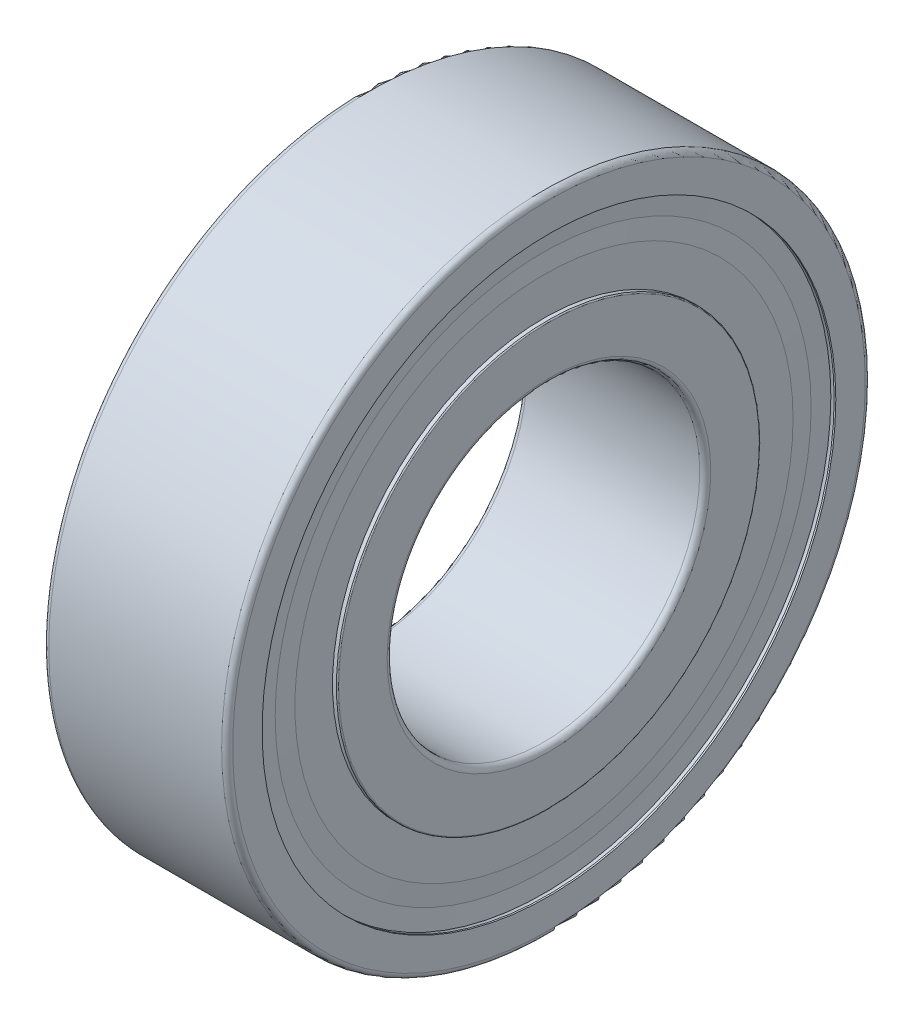
ISO-10303-21;
HEADER;
FILE_DESCRIPTION(('STEP AP214'),'2;1');
FILE_NAME('part.step','',(''),(''),'','','');
FILE_SCHEMA(('AUTOMOTIVE_DESIGN { 1 0 10303 214 1 1 1 1 }'));
ENDSEC;
DATA;
#1=APPLICATION_CONTEXT('core data for automotive mechanical design processes');
#2=APPLICATION_PROTOCOL_DEFINITION('international standard','automotive_design',2000,#1);
#3=PRODUCT_CONTEXT('',#1,'mechanical');
#4=PRODUCT('Part','Part','',(#3));
#5=PRODUCT_RELATED_PRODUCT_CATEGORY('part','',(#4));
#6=PRODUCT_DEFINITION_FORMATION('','',#4);
#7=PRODUCT_DEFINITION_CONTEXT('part definition',#1,'design');
#8=PRODUCT_DEFINITION('design','',#6,#7);
#9=PRODUCT_DEFINITION_SHAPE('','',#8);
#10=(LENGTH_UNIT() NAMED_UNIT(*) SI_UNIT(.MILLI.,.METRE.));
#11=(NAMED_UNIT(*) PLANE_ANGLE_UNIT() SI_UNIT($,.RADIAN.));
#12=(NAMED_UNIT(*) SI_UNIT($,.STERADIAN.) SOLID_ANGLE_UNIT());
#13=UNCERTAINTY_MEASURE_WITH_UNIT(LENGTH_MEASURE(1.E-05),#10,'distance_accuracy_value','');
#14=(GEOMETRIC_REPRESENTATION_CONTEXT(3) GLOBAL_UNCERTAINTY_ASSIGNED_CONTEXT((#13)) GLOBAL_UNIT_ASSIGNED_CONTEXT((#10,
#11,#12)) REPRESENTATION_CONTEXT('',''));
#15=CARTESIAN_POINT('',(0.,0.,0.));
#16=DIRECTION('',(0.,0.,1.));
#17=DIRECTION('',(1.,0.,0.));
#18=AXIS2_PLACEMENT_3D('',#15,#16,#17);
#19=CARTESIAN_POINT('',(50.,0.,0.));
#20=DIRECTION('',(1.,0.,0.));
#21=DIRECTION('',(0.,0.,-1.));
#22=AXIS2_PLACEMENT_3D('',#19,#20,#21);
#23=CYLINDRICAL_SURFACE('',#22,15.6);
#24=CARTESIAN_POINT('',(9.73,0.,0.));
#25=DIRECTION('',(1.,0.,0.));
#26=DIRECTION('',(0.,0.,-1.));
#27=AXIS2_PLACEMENT_3D('',#24,#25,#26);
#28=CIRCLE('',#27,15.6);
#29=CARTESIAN_POINT('',(9.73,0.,-15.6));
#30=VERTEX_POINT('',#29);
#31=EDGE_CURVE('P0_E11',#30,#30,#28,.T.);
#32=ORIENTED_EDGE('',*,*,#31,.F.);
#33=EDGE_LOOP('',(#32));
#34=FACE_BOUND('',#33,.T.);
#35=CARTESIAN_POINT('',(9.64,0.,0.));
#36=DIRECTION('',(1.,0.,0.));
#37=DIRECTION('',(0.,0.,-1.));
#38=AXIS2_PLACEMENT_3D('',#35,#36,#37);
#39=CIRCLE('',#38,15.6);
#40=CARTESIAN_POINT('',(9.64,0.,-15.6));
#41=VERTEX_POINT('',#40);
#42=EDGE_CURVE('P0_E166',#41,#41,#39,.T.);
#43=ORIENTED_EDGE('',*,*,#42,.T.);
#44=EDGE_LOOP('',(#43));
#45=FACE_BOUND('',#44,.T.);
#46=ADVANCED_FACE('P0_F16',(#34,#45),#23,.T.);
#47=CARTESIAN_POINT('',(9.685,0.,0.));
#48=DIRECTION('',(1.,0.,0.));
#49=DIRECTION('',(0.,0.,-1.));
#50=AXIS2_PLACEMENT_3D('',#47,#48,#49);
#51=CONICAL_SURFACE('',#50,14.5725,1.52702867499964);
#52=CARTESIAN_POINT('',(9.685,0.,0.));
#53=DIRECTION('',(1.,0.,0.));
#54=DIRECTION('',(0.,0.,-1.));
#55=AXIS2_PLACEMENT_3D('',#52,#53,#54);
#56=CIRCLE('',#55,14.5725);
#57=CARTESIAN_POINT('',(9.685,0.,-14.5725));
#58=VERTEX_POINT('',#57);
#59=EDGE_CURVE('P0_E26',#58,#58,#56,.T.);
#60=ORIENTED_EDGE('',*,*,#59,.F.);
#61=EDGE_LOOP('',(#60));
#62=FACE_BOUND('',#61,.T.);
#63=ORIENTED_EDGE('',*,*,#31,.T.);
#64=EDGE_LOOP('',(#63));
#65=FACE_BOUND('',#64,.T.);
#66=ADVANCED_FACE('P0_F202',(#62,#65),#51,.F.);
#67=CARTESIAN_POINT('',(9.73,0.,0.));
#68=DIRECTION('',(-1.,0.,0.));
#69=DIRECTION('',(0.,0.,1.));
#70=AXIS2_PLACEMENT_3D('',#67,#68,#69);
#71=CONICAL_SURFACE('',#70,13.545,1.52702867499964);
#72=CARTESIAN_POINT('',(9.73,0.,0.));
#73=DIRECTION('',(1.,0.,0.));
#74=DIRECTION('',(0.,0.,-1.));
#75=AXIS2_PLACEMENT_3D('',#72,#73,#74);
#76=CIRCLE('',#75,13.545);
#77=CARTESIAN_POINT('',(9.73,0.,-13.545));
#78=VERTEX_POINT('',#77);
#79=EDGE_CURVE('P0_E142',#78,#78,#76,.T.);
#80=ORIENTED_EDGE('',*,*,#79,.F.);
#81=EDGE_LOOP('',(#80));
#82=FACE_BOUND('',#81,.T.);
#83=ORIENTED_EDGE('',*,*,#59,.T.);
#84=EDGE_LOOP('',(#83));
#85=FACE_BOUND('',#84,.T.);
#86=ADVANCED_FACE('P0_F199',(#82,#85),#71,.T.);
#87=CARTESIAN_POINT('',(9.73,11.49,0.));
#88=DIRECTION('',(1.,0.,0.));
#89=DIRECTION('',(0.,1.,0.));
#90=AXIS2_PLACEMENT_3D('',#87,#88,#89);
#91=PLANE('',#90);
#92=CARTESIAN_POINT('',(9.73,0.,0.));
#93=DIRECTION('',(-1.,0.,0.));
#94=DIRECTION('',(0.,0.,-1.));
#95=AXIS2_PLACEMENT_3D('',#92,#93,#94);
#96=CIRCLE('',#95,11.5);
#97=CARTESIAN_POINT('',(9.73,0.,-11.5));
#98=VERTEX_POINT('',#97);
#99=EDGE_CURVE('P0_E147',#98,#98,#96,.T.);
#100=ORIENTED_EDGE('',*,*,#99,.T.);
#101=EDGE_LOOP('',(#100));
#102=FACE_BOUND('',#101,.T.);
#103=ORIENTED_EDGE('',*,*,#79,.T.);
#104=EDGE_LOOP('',(#103));
#105=FACE_BOUND('',#104,.T.);
#106=ADVANCED_FACE('P0_F197',(#102,#105),#91,.T.);
#107=CARTESIAN_POINT('',(9.55,0.,0.));
#108=DIRECTION('',(-1.,0.,0.));
#109=DIRECTION('',(0.,0.,1.));
#110=AXIS2_PLACEMENT_3D('',#107,#108,#109);
#111=CONICAL_SURFACE('',#110,13.545,1.52702867499964);
#112=CARTESIAN_POINT('',(9.55,0.,0.));
#113=DIRECTION('',(1.,0.,0.));
#114=DIRECTION('',(0.,0.,-1.));
#115=AXIS2_PLACEMENT_3D('',#112,#113,#114);
#116=CIRCLE('',#115,13.545);
#117=CARTESIAN_POINT('',(9.55,0.,-13.545));
#118=VERTEX_POINT('',#117);
#119=EDGE_CURVE('P0_E169',#118,#118,#116,.T.);
#120=ORIENTED_EDGE('',*,*,#119,.F.);
#121=EDGE_LOOP('',(#120));
#122=FACE_BOUND('',#121,.T.);
#123=CARTESIAN_POINT('',(9.63956204379562,0.,0.));
#124=DIRECTION('',(1.,0.,0.));
#125=DIRECTION('',(0.,0.,1.));
#126=AXIS2_PLACEMENT_3D('',#123,#124,#125);
#127=CIRCLE('',#126,11.5);
#128=CARTESIAN_POINT('',(9.63956204379562,0.,11.5));
#129=VERTEX_POINT('',#128);
#130=EDGE_CURVE('P0_E124',#129,#129,#127,.T.);
#131=ORIENTED_EDGE('',*,*,#130,.T.);
#132=EDGE_LOOP('',(#131));
#133=FACE_BOUND('',#132,.T.);
#134=ADVANCED_FACE('P0_F18',(#122,#133),#111,.F.);
#135=CARTESIAN_POINT('',(9.55,14.5725,0.));
#136=DIRECTION('',(-1.,0.,0.));
#137=DIRECTION('',(0.,0.,1.));
#138=AXIS2_PLACEMENT_3D('',#135,#136,#137);
#139=PLANE('',#138);
#140=CARTESIAN_POINT('',(9.55,0.,0.));
#141=DIRECTION('',(1.,0.,0.));
#142=DIRECTION('',(0.,0.,-1.));
#143=AXIS2_PLACEMENT_3D('',#140,#141,#142);
#144=CIRCLE('',#143,14.5725);
#145=CARTESIAN_POINT('',(9.55,0.,-14.5725));
#146=VERTEX_POINT('',#145);
#147=EDGE_CURVE('P0_E165',#146,#146,#144,.T.);
#148=ORIENTED_EDGE('',*,*,#147,.F.);
#149=EDGE_LOOP('',(#148));
#150=FACE_BOUND('',#149,.T.);
#151=ORIENTED_EDGE('',*,*,#119,.T.);
#152=EDGE_LOOP('',(#151));
#153=FACE_BOUND('',#152,.T.);
#154=ADVANCED_FACE('P0_F243',(#150,#153),#139,.T.);
#155=CARTESIAN_POINT('',(9.64,0.,0.));
#156=DIRECTION('',(1.,0.,0.));
#157=DIRECTION('',(0.,0.,-1.));
#158=AXIS2_PLACEMENT_3D('',#155,#156,#157);
#159=CONICAL_SURFACE('',#158,15.6,1.48342806694239);
#160=ORIENTED_EDGE('',*,*,#42,.F.);
#161=EDGE_LOOP('',(#160));
#162=FACE_BOUND('',#161,.T.);
#163=ORIENTED_EDGE('',*,*,#147,.T.);
#164=EDGE_LOOP('',(#163));
#165=FACE_BOUND('',#164,.T.);
#166=ADVANCED_FACE('P0_F245',(#162,#165),#159,.T.);
#167=CARTESIAN_POINT('',(0.45,0.,0.));
#168=DIRECTION('',(-1.,0.,0.));
#169=DIRECTION('',(0.,0.,1.));
#170=AXIS2_PLACEMENT_3D('',#167,#168,#169);
#171=CONICAL_SURFACE('',#170,14.5725,1.48342806694239);
#172=CARTESIAN_POINT('',(0.45,0.,0.));
#173=DIRECTION('',(1.,0.,0.));
#174=DIRECTION('',(0.,0.,-1.));
#175=AXIS2_PLACEMENT_3D('',#172,#173,#174);
#176=CIRCLE('',#175,14.5725);
#177=CARTESIAN_POINT('',(0.45,0.,-14.5725));
#178=VERTEX_POINT('',#177);
#179=EDGE_CURVE('P0_E162',#178,#178,#176,.T.);
#180=ORIENTED_EDGE('',*,*,#179,.F.);
#181=EDGE_LOOP('',(#180));
#182=FACE_BOUND('',#181,.T.);
#183=CARTESIAN_POINT('',(0.36,0.,0.));
#184=DIRECTION('',(1.,0.,0.));
#185=DIRECTION('',(0.,0.,-1.));
#186=AXIS2_PLACEMENT_3D('',#183,#184,#185);
#187=CIRCLE('',#186,15.6);
#188=CARTESIAN_POINT('',(0.36,0.,-15.6));
#189=VERTEX_POINT('',#188);
#190=EDGE_CURVE('P0_E139',#189,#189,#187,.T.);
#191=ORIENTED_EDGE('',*,*,#190,.T.);
#192=EDGE_LOOP('',(#191));
#193=FACE_BOUND('',#192,.T.);
#194=ADVANCED_FACE('P0_F251',(#182,#193),#171,.T.);
#195=CARTESIAN_POINT('',(0.45,13.545,0.));
#196=DIRECTION('',(1.,0.,0.));
#197=DIRECTION('',(0.,1.,0.));
#198=AXIS2_PLACEMENT_3D('',#195,#196,#197);
#199=PLANE('',#198);
#200=CARTESIAN_POINT('',(0.45,0.,0.));
#201=DIRECTION('',(1.,0.,0.));
#202=DIRECTION('',(0.,0.,-1.));
#203=AXIS2_PLACEMENT_3D('',#200,#201,#202);
#204=CIRCLE('',#203,13.545);
#205=CARTESIAN_POINT('',(0.45,0.,-13.545));
#206=VERTEX_POINT('',#205);
#207=EDGE_CURVE('P0_E155',#206,#206,#204,.T.);
#208=ORIENTED_EDGE('',*,*,#207,.F.);
#209=EDGE_LOOP('',(#208));
#210=FACE_BOUND('',#209,.T.);
#211=ORIENTED_EDGE('',*,*,#179,.T.);
#212=EDGE_LOOP('',(#211));
#213=FACE_BOUND('',#212,.T.);
#214=ADVANCED_FACE('P0_F248',(#210,#213),#199,.T.);
#215=CARTESIAN_POINT('',(0.36,0.,0.));
#216=DIRECTION('',(1.,0.,0.));
#217=DIRECTION('',(0.,0.,-1.));
#218=AXIS2_PLACEMENT_3D('',#215,#216,#217);
#219=CONICAL_SURFACE('',#218,11.49,1.52702867499964);
#220=CARTESIAN_POINT('',(0.360437956204379,0.,0.));
#221=DIRECTION('',(-1.,0.,0.));
#222=DIRECTION('',(0.,0.,-1.));
#223=AXIS2_PLACEMENT_3D('',#220,#221,#222);
#224=CIRCLE('',#223,11.5);
#225=CARTESIAN_POINT('',(0.360437956204379,0.,-11.5));
#226=VERTEX_POINT('',#225);
#227=EDGE_CURVE('P0_E146',#226,#226,#224,.T.);
#228=ORIENTED_EDGE('',*,*,#227,.T.);
#229=EDGE_LOOP('',(#228));
#230=FACE_BOUND('',#229,.T.);
#231=ORIENTED_EDGE('',*,*,#207,.T.);
#232=EDGE_LOOP('',(#231));
#233=FACE_BOUND('',#232,.T.);
#234=ADVANCED_FACE('P0_F230',(#230,#233),#219,.F.);
#235=CARTESIAN_POINT('',(0.27,13.545,0.));
#236=DIRECTION('',(-1.,0.,0.));
#237=DIRECTION('',(0.,0.,1.));
#238=AXIS2_PLACEMENT_3D('',#235,#236,#237);
#239=PLANE('',#238);
#240=CARTESIAN_POINT('',(0.27,0.,0.));
#241=DIRECTION('',(1.,0.,0.));
#242=DIRECTION('',(0.,0.,-1.));
#243=AXIS2_PLACEMENT_3D('',#240,#241,#242);
#244=CIRCLE('',#243,13.545);
#245=CARTESIAN_POINT('',(0.27,0.,-13.545));
#246=VERTEX_POINT('',#245);
#247=EDGE_CURVE('P0_E138',#246,#246,#244,.T.);
#248=ORIENTED_EDGE('',*,*,#247,.F.);
#249=EDGE_LOOP('',(#248));
#250=FACE_BOUND('',#249,.T.);
#251=CARTESIAN_POINT('',(0.27,0.,0.));
#252=DIRECTION('',(1.,0.,0.));
#253=DIRECTION('',(0.,0.,1.));
#254=AXIS2_PLACEMENT_3D('',#251,#252,#253);
#255=CIRCLE('',#254,11.5);
#256=CARTESIAN_POINT('',(0.27,0.,11.5));
#257=VERTEX_POINT('',#256);
#258=EDGE_CURVE('P0_E148',#257,#257,#255,.T.);
#259=ORIENTED_EDGE('',*,*,#258,.T.);
#260=EDGE_LOOP('',(#259));
#261=FACE_BOUND('',#260,.T.);
#262=ADVANCED_FACE('P0_F226',(#250,#261),#239,.T.);
#263=CARTESIAN_POINT('',(0.315,0.,0.));
#264=DIRECTION('',(1.,0.,0.));
#265=DIRECTION('',(0.,0.,-1.));
#266=AXIS2_PLACEMENT_3D('',#263,#264,#265);
#267=CONICAL_SURFACE('',#266,14.5725,1.52702867499964);
#268=CARTESIAN_POINT('',(0.315,0.,0.));
#269=DIRECTION('',(1.,0.,0.));
#270=DIRECTION('',(0.,0.,-1.));
#271=AXIS2_PLACEMENT_3D('',#268,#269,#270);
#272=CIRCLE('',#271,14.5725);
#273=CARTESIAN_POINT('',(0.315,0.,-14.5725));
#274=VERTEX_POINT('',#273);
#275=EDGE_CURVE('P0_E136',#274,#274,#272,.T.);
#276=ORIENTED_EDGE('',*,*,#275,.F.);
#277=EDGE_LOOP('',(#276));
#278=FACE_BOUND('',#277,.T.);
#279=ORIENTED_EDGE('',*,*,#247,.T.);
#280=EDGE_LOOP('',(#279));
#281=FACE_BOUND('',#280,.T.);
#282=ADVANCED_FACE('P0_F229',(#278,#281),#267,.T.);
#283=CARTESIAN_POINT('',(0.27,0.,0.));
#284=DIRECTION('',(-1.,0.,0.));
#285=DIRECTION('',(0.,0.,1.));
#286=AXIS2_PLACEMENT_3D('',#283,#284,#285);
#287=CONICAL_SURFACE('',#286,15.6,1.52702867499964);
#288=CARTESIAN_POINT('',(0.27,0.,0.));
#289=DIRECTION('',(1.,0.,0.));
#290=DIRECTION('',(0.,0.,-1.));
#291=AXIS2_PLACEMENT_3D('',#288,#289,#290);
#292=CIRCLE('',#291,15.6);
#293=CARTESIAN_POINT('',(0.27,0.,-15.6));
#294=VERTEX_POINT('',#293);
#295=EDGE_CURVE('P0_E183',#294,#294,#292,.T.);
#296=ORIENTED_EDGE('',*,*,#295,.F.);
#297=EDGE_LOOP('',(#296));
#298=FACE_BOUND('',#297,.T.);
#299=ORIENTED_EDGE('',*,*,#275,.T.);
#300=EDGE_LOOP('',(#299));
#301=FACE_BOUND('',#300,.T.);
#302=ADVANCED_FACE('P0_F241',(#298,#301),#287,.F.);
#303=CARTESIAN_POINT('',(50.,0.,0.));
#304=DIRECTION('',(1.,0.,0.));
#305=DIRECTION('',(0.,0.,-1.));
#306=AXIS2_PLACEMENT_3D('',#303,#304,#305);
#307=CYLINDRICAL_SURFACE('',#306,15.6);
#308=ORIENTED_EDGE('',*,*,#190,.F.);
#309=EDGE_LOOP('',(#308));
#310=FACE_BOUND('',#309,.T.);
#311=ORIENTED_EDGE('',*,*,#295,.T.);
#312=EDGE_LOOP('',(#311));
#313=FACE_BOUND('',#312,.T.);
#314=ADVANCED_FACE('P0_F270',(#310,#313),#307,.T.);
#315=CARTESIAN_POINT('',(50.,0.,0.));
#316=DIRECTION('',(1.,0.,0.));
#317=DIRECTION('',(0.,0.,-1.));
#318=AXIS2_PLACEMENT_3D('',#315,#316,#317);
#319=CYLINDRICAL_SURFACE('',#318,11.5);
#320=CARTESIAN_POINT('',(3.15090265264373,0.,0.));
#321=DIRECTION('',(1.,0.,0.));
#322=DIRECTION('',(0.,0.,-1.));
#323=AXIS2_PLACEMENT_3D('',#320,#321,#322);
#324=CIRCLE('',#323,11.5);
#325=CARTESIAN_POINT('',(3.15090265264373,0.,-11.5));
#326=VERTEX_POINT('',#325);
#327=EDGE_CURVE('P0_E143',#326,#326,#324,.T.);
#328=ORIENTED_EDGE('',*,*,#327,.F.);
#329=EDGE_LOOP('',(#328));
#330=FACE_BOUND('',#329,.T.);
#331=ORIENTED_EDGE('',*,*,#227,.F.);
#332=EDGE_LOOP('',(#331));
#333=FACE_BOUND('',#332,.T.);
#334=ADVANCED_FACE('P0_F272',(#330,#333),#319,.T.);
#335=CARTESIAN_POINT('',(5.,0.,0.));
#336=DIRECTION('',(1.,0.,0.));
#337=DIRECTION('',(0.,0.,-1.));
#338=AXIS2_PLACEMENT_3D('',#335,#336,#337);
#339=TOROIDAL_SURFACE('',#338,13.,2.381);
#340=ORIENTED_EDGE('',*,*,#327,.T.);
#341=EDGE_LOOP('',(#340));
#342=FACE_BOUND('',#341,.T.);
#343=CARTESIAN_POINT('',(6.84909734735627,0.,0.));
#344=DIRECTION('',(1.,0.,0.));
#345=DIRECTION('',(0.,0.,-1.));
#346=AXIS2_PLACEMENT_3D('',#343,#344,#345);
#347=CIRCLE('',#346,11.5);
#348=CARTESIAN_POINT('',(6.84909734735627,0.,-11.5));
#349=VERTEX_POINT('',#348);
#350=EDGE_CURVE('P0_E120',#349,#349,#347,.T.);
#351=ORIENTED_EDGE('',*,*,#350,.F.);
#352=EDGE_LOOP('',(#351));
#353=FACE_BOUND('',#352,.T.);
#354=ADVANCED_FACE('P0_F268',(#342,#353),#339,.F.);
#355=CARTESIAN_POINT('',(50.,0.,0.));
#356=DIRECTION('',(1.,0.,0.));
#357=DIRECTION('',(0.,0.,-1.));
#358=AXIS2_PLACEMENT_3D('',#355,#356,#357);
#359=CYLINDRICAL_SURFACE('',#358,11.5);
#360=CARTESIAN_POINT('',(9.94,0.,0.));
#361=DIRECTION('',(1.,0.,0.));
#362=DIRECTION('',(0.,0.,-1.));
#363=AXIS2_PLACEMENT_3D('',#360,#361,#362);
#364=CIRCLE('',#363,11.5);
#365=CARTESIAN_POINT('',(9.94,0.,-11.5));
#366=VERTEX_POINT('',#365);
#367=EDGE_CURVE('P0_E173',#366,#366,#364,.T.);
#368=ORIENTED_EDGE('',*,*,#367,.F.);
#369=EDGE_LOOP('',(#368));
#370=FACE_BOUND('',#369,.T.);
#371=ORIENTED_EDGE('',*,*,#99,.F.);
#372=EDGE_LOOP('',(#371));
#373=FACE_BOUND('',#372,.T.);
#374=ADVANCED_FACE('P0_F234',(#370,#373),#359,.T.);
#375=CARTESIAN_POINT('',(9.94,0.,0.));
#376=DIRECTION('',(1.,0.,0.));
#377=DIRECTION('',(0.,0.,-1.));
#378=AXIS2_PLACEMENT_3D('',#375,#376,#377);
#379=TOROIDAL_SURFACE('',#378,11.44,0.0599999999999976);
#380=CARTESIAN_POINT('',(10.,0.,0.));
#381=DIRECTION('',(1.,0.,0.));
#382=DIRECTION('',(0.,0.,-1.));
#383=AXIS2_PLACEMENT_3D('',#380,#381,#382);
#384=CIRCLE('',#383,11.44);
#385=CARTESIAN_POINT('',(10.,0.,-11.44));
#386=VERTEX_POINT('',#385);
#387=EDGE_CURVE('P0_E160',#386,#386,#384,.T.);
#388=ORIENTED_EDGE('',*,*,#387,.F.);
#389=EDGE_LOOP('',(#388));
#390=FACE_BOUND('',#389,.T.);
#391=ORIENTED_EDGE('',*,*,#367,.T.);
#392=EDGE_LOOP('',(#391));
#393=FACE_BOUND('',#392,.T.);
#394=ADVANCED_FACE('P0_F218',(#390,#393),#379,.T.);
#395=CARTESIAN_POINT('',(10.,8.8,0.));
#396=DIRECTION('',(1.,0.,0.));
#397=DIRECTION('',(0.,1.,0.));
#398=AXIS2_PLACEMENT_3D('',#395,#396,#397);
#399=PLANE('',#398);
#400=CARTESIAN_POINT('',(10.,0.,0.));
#401=DIRECTION('',(1.,0.,0.));
#402=DIRECTION('',(0.,0.,-1.));
#403=AXIS2_PLACEMENT_3D('',#400,#401,#402);
#404=CIRCLE('',#403,8.8);
#405=CARTESIAN_POINT('',(10.,0.,-8.8));
#406=VERTEX_POINT('',#405);
#407=EDGE_CURVE('P0_E156',#406,#406,#404,.T.);
#408=ORIENTED_EDGE('',*,*,#407,.F.);
#409=EDGE_LOOP('',(#408));
#410=FACE_BOUND('',#409,.T.);
#411=ORIENTED_EDGE('',*,*,#387,.T.);
#412=EDGE_LOOP('',(#411));
#413=FACE_BOUND('',#412,.T.);
#414=ADVANCED_FACE('P0_F214',(#410,#413),#399,.T.);
#415=CARTESIAN_POINT('',(9.7,0.,0.));
#416=DIRECTION('',(1.,0.,0.));
#417=DIRECTION('',(0.,0.,-1.));
#418=AXIS2_PLACEMENT_3D('',#415,#416,#417);
#419=TOROIDAL_SURFACE('',#418,8.8,0.300000000000005);
#420=CARTESIAN_POINT('',(9.7,0.,0.));
#421=DIRECTION('',(1.,0.,0.));
#422=DIRECTION('',(0.,0.,-1.));
#423=AXIS2_PLACEMENT_3D('',#420,#421,#422);
#424=CIRCLE('',#423,8.5);
#425=CARTESIAN_POINT('',(9.7,0.,-8.5));
#426=VERTEX_POINT('',#425);
#427=EDGE_CURVE('P0_E161',#426,#426,#424,.T.);
#428=ORIENTED_EDGE('',*,*,#427,.F.);
#429=EDGE_LOOP('',(#428));
#430=FACE_BOUND('',#429,.T.);
#431=ORIENTED_EDGE('',*,*,#407,.T.);
#432=EDGE_LOOP('',(#431));
#433=FACE_BOUND('',#432,.T.);
#434=ADVANCED_FACE('P0_F217',(#430,#433),#419,.T.);
#435=CARTESIAN_POINT('',(50.,0.,0.));
#436=DIRECTION('',(1.,0.,0.));
#437=DIRECTION('',(0.,0.,-1.));
#438=AXIS2_PLACEMENT_3D('',#435,#436,#437);
#439=CYLINDRICAL_SURFACE('',#438,8.5);
#440=CARTESIAN_POINT('',(0.3,0.,0.));
#441=DIRECTION('',(1.,0.,0.));
#442=DIRECTION('',(0.,0.,-1.));
#443=AXIS2_PLACEMENT_3D('',#440,#441,#442);
#444=CIRCLE('',#443,8.5);
#445=CARTESIAN_POINT('',(0.3,0.,-8.5));
#446=VERTEX_POINT('',#445);
#447=EDGE_CURVE('P0_E182',#446,#446,#444,.T.);
#448=ORIENTED_EDGE('',*,*,#447,.F.);
#449=EDGE_LOOP('',(#448));
#450=FACE_BOUND('',#449,.T.);
#451=ORIENTED_EDGE('',*,*,#427,.T.);
#452=EDGE_LOOP('',(#451));
#453=FACE_BOUND('',#452,.T.);
#454=ADVANCED_FACE('P0_F224',(#450,#453),#439,.F.);
#455=CARTESIAN_POINT('',(0.3,0.,0.));
#456=DIRECTION('',(1.,0.,0.));
#457=DIRECTION('',(0.,0.,-1.));
#458=AXIS2_PLACEMENT_3D('',#455,#456,#457);
#459=TOROIDAL_SURFACE('',#458,8.8,0.3);
#460=CARTESIAN_POINT('',(0.,0.,0.));
#461=DIRECTION('',(1.,0.,0.));
#462=DIRECTION('',(0.,0.,-1.));
#463=AXIS2_PLACEMENT_3D('',#460,#461,#462);
#464=CIRCLE('',#463,8.8);
#465=CARTESIAN_POINT('',(0.,0.,-8.8));
#466=VERTEX_POINT('',#465);
#467=EDGE_CURVE('P0_E189',#466,#466,#464,.T.);
#468=ORIENTED_EDGE('',*,*,#467,.F.);
#469=EDGE_LOOP('',(#468));
#470=FACE_BOUND('',#469,.T.);
#471=ORIENTED_EDGE('',*,*,#447,.T.);
#472=EDGE_LOOP('',(#471));
#473=FACE_BOUND('',#472,.T.);
#474=ADVANCED_FACE('P0_F220',(#470,#473),#459,.T.);
#475=CARTESIAN_POINT('',(0.,11.44,0.));
#476=DIRECTION('',(-1.,0.,0.));
#477=DIRECTION('',(0.,0.,1.));
#478=AXIS2_PLACEMENT_3D('',#475,#476,#477);
#479=PLANE('',#478);
#480=CARTESIAN_POINT('',(0.,0.,0.));
#481=DIRECTION('',(1.,0.,0.));
#482=DIRECTION('',(0.,0.,-1.));
#483=AXIS2_PLACEMENT_3D('',#480,#481,#482);
#484=CIRCLE('',#483,11.44);
#485=CARTESIAN_POINT('',(0.,0.,-11.44));
#486=VERTEX_POINT('',#485);
#487=EDGE_CURVE('P0_E134',#486,#486,#484,.T.);
#488=ORIENTED_EDGE('',*,*,#487,.F.);
#489=EDGE_LOOP('',(#488));
#490=FACE_BOUND('',#489,.T.);
#491=ORIENTED_EDGE('',*,*,#467,.T.);
#492=EDGE_LOOP('',(#491));
#493=FACE_BOUND('',#492,.T.);
#494=ADVANCED_FACE('P0_F223',(#490,#493),#479,.T.);
#495=CARTESIAN_POINT('',(0.0599999999999987,0.,0.));
#496=DIRECTION('',(1.,0.,0.));
#497=DIRECTION('',(0.,0.,-1.));
#498=AXIS2_PLACEMENT_3D('',#495,#496,#497);
#499=TOROIDAL_SURFACE('',#498,11.44,0.0599999999999993);
#500=CARTESIAN_POINT('',(0.0599999999999976,0.,0.));
#501=DIRECTION('',(1.,0.,0.));
#502=DIRECTION('',(0.,0.,-1.));
#503=AXIS2_PLACEMENT_3D('',#500,#501,#502);
#504=CIRCLE('',#503,11.5);
#505=CARTESIAN_POINT('',(0.0599999999999976,0.,-11.5));
#506=VERTEX_POINT('',#505);
#507=EDGE_CURVE('P0_E130',#506,#506,#504,.T.);
#508=ORIENTED_EDGE('',*,*,#507,.F.);
#509=EDGE_LOOP('',(#508));
#510=FACE_BOUND('',#509,.T.);
#511=ORIENTED_EDGE('',*,*,#487,.T.);
#512=EDGE_LOOP('',(#511));
#513=FACE_BOUND('',#512,.T.);
#514=ADVANCED_FACE('P0_F275',(#510,#513),#499,.T.);
#515=CARTESIAN_POINT('',(50.,0.,0.));
#516=DIRECTION('',(1.,0.,0.));
#517=DIRECTION('',(0.,0.,-1.));
#518=AXIS2_PLACEMENT_3D('',#515,#516,#517);
#519=CYLINDRICAL_SURFACE('',#518,11.5);
#520=ORIENTED_EDGE('',*,*,#258,.F.);
#521=EDGE_LOOP('',(#520));
#522=FACE_BOUND('',#521,.T.);
#523=ORIENTED_EDGE('',*,*,#507,.T.);
#524=EDGE_LOOP('',(#523));
#525=FACE_BOUND('',#524,.T.);
#526=ADVANCED_FACE('P0_F261',(#522,#525),#519,.T.);
#527=CARTESIAN_POINT('',(50.,0.,0.));
#528=DIRECTION('',(1.,0.,0.));
#529=DIRECTION('',(0.,0.,-1.));
#530=AXIS2_PLACEMENT_3D('',#527,#528,#529);
#531=CYLINDRICAL_SURFACE('',#530,11.5);
#532=ORIENTED_EDGE('',*,*,#130,.F.);
#533=EDGE_LOOP('',(#532));
#534=FACE_BOUND('',#533,.T.);
#535=ORIENTED_EDGE('',*,*,#350,.T.);
#536=EDGE_LOOP('',(#535));
#537=FACE_BOUND('',#536,.T.);
#538=ADVANCED_FACE('P0_F121',(#534,#537),#531,.T.);
#539=CLOSED_SHELL('',(#46,#66,#86,#106,#134,#154,#166,#194,#214,#234,#262,#282,#302,#314,#334,
#354,#374,#394,#414,#434,#454,#474,#494,#514,#526,#538));
#540=MANIFOLD_SOLID_BREP('P0_B1',#539);
#541=CARTESIAN_POINT('',(50.,0.,0.));
#542=DIRECTION('',(1.,0.,0.));
#543=DIRECTION('',(0.,0.,-1.));
#544=AXIS2_PLACEMENT_3D('',#541,#542,#543);
#545=CYLINDRICAL_SURFACE('',#544,17.5);
#546=CARTESIAN_POINT('',(9.7,0.,0.));
#547=DIRECTION('',(1.,0.,0.));
#548=DIRECTION('',(0.,0.,-1.));
#549=AXIS2_PLACEMENT_3D('',#546,#547,#548);
#550=CIRCLE('',#549,17.5);
#551=CARTESIAN_POINT('',(9.7,0.,-17.5));
#552=VERTEX_POINT('',#551);
#553=EDGE_CURVE('P1_E12',#552,#552,#550,.T.);
#554=ORIENTED_EDGE('',*,*,#553,.F.);
#555=EDGE_LOOP('',(#554));
#556=FACE_BOUND('',#555,.T.);
#557=CARTESIAN_POINT('',(0.3,0.,0.));
#558=DIRECTION('',(1.,0.,0.));
#559=DIRECTION('',(0.,0.,-1.));
#560=AXIS2_PLACEMENT_3D('',#557,#558,#559);
#561=CIRCLE('',#560,17.5);
#562=CARTESIAN_POINT('',(0.3,0.,-17.5));
#563=VERTEX_POINT('',#562);
#564=EDGE_CURVE('P1_E104',#563,#563,#561,.T.);
#565=ORIENTED_EDGE('',*,*,#564,.T.);
#566=EDGE_LOOP('',(#565));
#567=FACE_BOUND('',#566,.T.);
#568=ADVANCED_FACE('P1_F18',(#556,#567),#545,.T.);
#569=CARTESIAN_POINT('',(9.7,0.,0.));
#570=DIRECTION('',(1.,0.,0.));
#571=DIRECTION('',(0.,0.,-1.));
#572=AXIS2_PLACEMENT_3D('',#569,#570,#571);
#573=TOROIDAL_SURFACE('',#572,17.2,0.3);
#574=CARTESIAN_POINT('',(10.,0.,0.));
#575=DIRECTION('',(1.,0.,0.));
#576=DIRECTION('',(0.,0.,-1.));
#577=AXIS2_PLACEMENT_3D('',#574,#575,#576);
#578=CIRCLE('',#577,17.2);
#579=CARTESIAN_POINT('',(10.,0.,-17.2));
#580=VERTEX_POINT('',#579);
#581=EDGE_CURVE('P1_E29',#580,#580,#578,.T.);
#582=ORIENTED_EDGE('',*,*,#581,.F.);
#583=EDGE_LOOP('',(#582));
#584=FACE_BOUND('',#583,.T.);
#585=ORIENTED_EDGE('',*,*,#553,.T.);
#586=EDGE_LOOP('',(#585));
#587=FACE_BOUND('',#586,.T.);
#588=ADVANCED_FACE('P1_F20',(#584,#587),#573,.T.);
#589=CARTESIAN_POINT('',(10.,15.6,0.));
#590=DIRECTION('',(1.,0.,0.));
#591=DIRECTION('',(0.,1.,0.));
#592=AXIS2_PLACEMENT_3D('',#589,#590,#591);
#593=PLANE('',#592);
#594=CARTESIAN_POINT('',(10.,0.,0.));
#595=DIRECTION('',(1.,0.,0.));
#596=DIRECTION('',(0.,0.,-1.));
#597=AXIS2_PLACEMENT_3D('',#594,#595,#596);
#598=CIRCLE('',#597,15.6);
#599=CARTESIAN_POINT('',(10.,0.,-15.6));
#600=VERTEX_POINT('',#599);
#601=EDGE_CURVE('P1_E88',#600,#600,#598,.T.);
#602=ORIENTED_EDGE('',*,*,#601,.F.);
#603=EDGE_LOOP('',(#602));
#604=FACE_BOUND('',#603,.T.);
#605=ORIENTED_EDGE('',*,*,#581,.T.);
#606=EDGE_LOOP('',(#605));
#607=FACE_BOUND('',#606,.T.);
#608=ADVANCED_FACE('P1_F153',(#604,#607),#593,.T.);
#609=CARTESIAN_POINT('',(50.,0.,0.));
#610=DIRECTION('',(1.,0.,0.));
#611=DIRECTION('',(0.,0.,-1.));
#612=AXIS2_PLACEMENT_3D('',#609,#610,#611);
#613=CYLINDRICAL_SURFACE('',#612,15.6);
#614=CARTESIAN_POINT('',(9.91,0.,0.));
#615=DIRECTION('',(1.,0.,0.));
#616=DIRECTION('',(0.,0.,-1.));
#617=AXIS2_PLACEMENT_3D('',#614,#615,#616);
#618=CIRCLE('',#617,15.6);
#619=CARTESIAN_POINT('',(9.91,0.,-15.6));
#620=VERTEX_POINT('',#619);
#621=EDGE_CURVE('P1_E92',#620,#620,#618,.T.);
#622=ORIENTED_EDGE('',*,*,#621,.F.);
#623=EDGE_LOOP('',(#622));
#624=FACE_BOUND('',#623,.T.);
#625=ORIENTED_EDGE('',*,*,#601,.T.);
#626=EDGE_LOOP('',(#625));
#627=FACE_BOUND('',#626,.T.);
#628=ADVANCED_FACE('P1_F89',(#624,#627),#613,.F.);
#629=CARTESIAN_POINT('',(9.73,0.,0.));
#630=DIRECTION('',(1.,0.,0.));
#631=DIRECTION('',(0.,0.,-1.));
#632=AXIS2_PLACEMENT_3D('',#629,#630,#631);
#633=TOROIDAL_SURFACE('',#632,15.6000000094977,0.18);
#634=ORIENTED_EDGE('',*,*,#621,.T.);
#635=EDGE_LOOP('',(#634));
#636=FACE_BOUND('',#635,.T.);
#637=CARTESIAN_POINT('',(9.55,0.,0.));
#638=DIRECTION('',(1.,0.,0.));
#639=DIRECTION('',(0.,0.,-1.));
#640=AXIS2_PLACEMENT_3D('',#637,#638,#639);
#641=CIRCLE('',#640,15.6);
#642=CARTESIAN_POINT('',(9.55,0.,-15.6));
#643=VERTEX_POINT('',#642);
#644=EDGE_CURVE('P1_E100',#643,#643,#641,.T.);
#645=ORIENTED_EDGE('',*,*,#644,.F.);
#646=EDGE_LOOP('',(#645));
#647=FACE_BOUND('',#646,.T.);
#648=ADVANCED_FACE('P1_F156',(#636,#647),#633,.F.);
#649=CARTESIAN_POINT('',(9.37367301929154,0.,0.));
#650=DIRECTION('',(1.,0.,0.));
#651=DIRECTION('',(0.,0.,-1.));
#652=AXIS2_PLACEMENT_3D('',#649,#650,#651);
#653=CONICAL_SURFACE('',#652,14.6,1.39626340159546);
#654=CARTESIAN_POINT('',(9.37367301929154,0.,0.));
#655=DIRECTION('',(1.,0.,0.));
#656=DIRECTION('',(0.,0.,-1.));
#657=AXIS2_PLACEMENT_3D('',#654,#655,#656);
#658=CIRCLE('',#657,14.6);
#659=CARTESIAN_POINT('',(9.37367301929154,0.,-14.6));
#660=VERTEX_POINT('',#659);
#661=EDGE_CURVE('P1_E22',#660,#660,#658,.T.);
#662=ORIENTED_EDGE('',*,*,#661,.F.);
#663=EDGE_LOOP('',(#662));
#664=FACE_BOUND('',#663,.T.);
#665=ORIENTED_EDGE('',*,*,#644,.T.);
#666=EDGE_LOOP('',(#665));
#667=FACE_BOUND('',#666,.T.);
#668=ADVANCED_FACE('P1_F159',(#664,#667),#653,.F.);
#669=CARTESIAN_POINT('',(50.,0.,0.));
#670=DIRECTION('',(1.,0.,0.));
#671=DIRECTION('',(0.,0.,-1.));
#672=AXIS2_PLACEMENT_3D('',#669,#670,#671);
#673=CYLINDRICAL_SURFACE('',#672,14.6);
#674=CARTESIAN_POINT('',(6.76328131618299,0.,0.));
#675=DIRECTION('',(1.,0.,0.));
#676=DIRECTION('',(0.,0.,-1.));
#677=AXIS2_PLACEMENT_3D('',#674,#675,#676);
#678=CIRCLE('',#677,14.6);
#679=CARTESIAN_POINT('',(6.76328131618299,0.,-14.6));
#680=VERTEX_POINT('',#679);
#681=EDGE_CURVE('P1_E120',#680,#680,#678,.T.);
#682=ORIENTED_EDGE('',*,*,#681,.F.);
#683=EDGE_LOOP('',(#682));
#684=FACE_BOUND('',#683,.T.);
#685=ORIENTED_EDGE('',*,*,#661,.T.);
#686=EDGE_LOOP('',(#685));
#687=FACE_BOUND('',#686,.T.);
#688=ADVANCED_FACE('P1_F167',(#684,#687),#673,.F.);
#689=CARTESIAN_POINT('',(5.,0.,0.));
#690=DIRECTION('',(1.,0.,0.));
#691=DIRECTION('',(0.,0.,-1.));
#692=AXIS2_PLACEMENT_3D('',#689,#690,#691);
#693=TOROIDAL_SURFACE('',#692,13.,2.381);
#694=ORIENTED_EDGE('',*,*,#681,.T.);
#695=EDGE_LOOP('',(#694));
#696=FACE_BOUND('',#695,.T.);
#697=CARTESIAN_POINT('',(3.23671868381702,0.,0.));
#698=DIRECTION('',(1.,0.,0.));
#699=DIRECTION('',(0.,0.,-1.));
#700=AXIS2_PLACEMENT_3D('',#697,#698,#699);
#701=CIRCLE('',#700,14.6);
#702=CARTESIAN_POINT('',(3.23671868381702,0.,-14.6));
#703=VERTEX_POINT('',#702);
#704=EDGE_CURVE('P1_E117',#703,#703,#701,.T.);
#705=ORIENTED_EDGE('',*,*,#704,.F.);
#706=EDGE_LOOP('',(#705));
#707=FACE_BOUND('',#706,.T.);
#708=ADVANCED_FACE('P1_F179',(#696,#707),#693,.F.);
#709=CARTESIAN_POINT('',(50.,0.,0.));
#710=DIRECTION('',(1.,0.,0.));
#711=DIRECTION('',(0.,0.,-1.));
#712=AXIS2_PLACEMENT_3D('',#709,#710,#711);
#713=CYLINDRICAL_SURFACE('',#712,14.6);
#714=CARTESIAN_POINT('',(0.626326980708462,0.,0.));
#715=DIRECTION('',(1.,0.,0.));
#716=DIRECTION('',(0.,0.,-1.));
#717=AXIS2_PLACEMENT_3D('',#714,#715,#716);
#718=CIRCLE('',#717,14.6);
#719=CARTESIAN_POINT('',(0.626326980708462,0.,-14.6));
#720=VERTEX_POINT('',#719);
#721=EDGE_CURVE('P1_E113',#720,#720,#718,.T.);
#722=ORIENTED_EDGE('',*,*,#721,.F.);
#723=EDGE_LOOP('',(#722));
#724=FACE_BOUND('',#723,.T.);
#725=ORIENTED_EDGE('',*,*,#704,.T.);
#726=EDGE_LOOP('',(#725));
#727=FACE_BOUND('',#726,.T.);
#728=ADVANCED_FACE('P1_F176',(#724,#727),#713,.F.);
#729=CARTESIAN_POINT('',(0.45,0.,0.));
#730=DIRECTION('',(-1.,0.,0.));
#731=DIRECTION('',(0.,0.,1.));
#732=AXIS2_PLACEMENT_3D('',#729,#730,#731);
#733=CONICAL_SURFACE('',#732,15.6,1.39626340159546);
#734=CARTESIAN_POINT('',(0.45,0.,0.));
#735=DIRECTION('',(1.,0.,0.));
#736=DIRECTION('',(0.,0.,-1.));
#737=AXIS2_PLACEMENT_3D('',#734,#735,#736);
#738=CIRCLE('',#737,15.6);
#739=CARTESIAN_POINT('',(0.45,0.,-15.6));
#740=VERTEX_POINT('',#739);
#741=EDGE_CURVE('P1_E110',#740,#740,#738,.T.);
#742=ORIENTED_EDGE('',*,*,#741,.F.);
#743=EDGE_LOOP('',(#742));
#744=FACE_BOUND('',#743,.T.);
#745=ORIENTED_EDGE('',*,*,#721,.T.);
#746=EDGE_LOOP('',(#745));
#747=FACE_BOUND('',#746,.T.);
#748=ADVANCED_FACE('P1_F170',(#744,#747),#733,.F.);
#749=CARTESIAN_POINT('',(0.27,0.,0.));
#750=DIRECTION('',(1.,0.,0.));
#751=DIRECTION('',(0.,0.,-1.));
#752=AXIS2_PLACEMENT_3D('',#749,#750,#751);
#753=TOROIDAL_SURFACE('',#752,15.6,0.18);
#754=ORIENTED_EDGE('',*,*,#741,.T.);
#755=EDGE_LOOP('',(#754));
#756=FACE_BOUND('',#755,.T.);
#757=CARTESIAN_POINT('',(0.09,0.,0.));
#758=DIRECTION('',(1.,0.,0.));
#759=DIRECTION('',(0.,0.,-1.));
#760=AXIS2_PLACEMENT_3D('',#757,#758,#759);
#761=CIRCLE('',#760,15.6);
#762=CARTESIAN_POINT('',(0.09,0.,-15.6));
#763=VERTEX_POINT('',#762);
#764=EDGE_CURVE('P1_E107',#763,#763,#761,.T.);
#765=ORIENTED_EDGE('',*,*,#764,.F.);
#766=EDGE_LOOP('',(#765));
#767=FACE_BOUND('',#766,.T.);
#768=ADVANCED_FACE('P1_F163',(#756,#767),#753,.F.);
#769=CARTESIAN_POINT('',(50.,0.,0.));
#770=DIRECTION('',(1.,0.,0.));
#771=DIRECTION('',(0.,0.,-1.));
#772=AXIS2_PLACEMENT_3D('',#769,#770,#771);
#773=CYLINDRICAL_SURFACE('',#772,15.6);
#774=CARTESIAN_POINT('',(0.,0.,0.));
#775=DIRECTION('',(1.,0.,0.));
#776=DIRECTION('',(0.,0.,-1.));
#777=AXIS2_PLACEMENT_3D('',#774,#775,#776);
#778=CIRCLE('',#777,15.6);
#779=CARTESIAN_POINT('',(0.,0.,-15.6));
#780=VERTEX_POINT('',#779);
#781=EDGE_CURVE('P1_E106',#780,#780,#778,.T.);
#782=ORIENTED_EDGE('',*,*,#781,.F.);
#783=EDGE_LOOP('',(#782));
#784=FACE_BOUND('',#783,.T.);
#785=ORIENTED_EDGE('',*,*,#764,.T.);
#786=EDGE_LOOP('',(#785));
#787=FACE_BOUND('',#786,.T.);
#788=ADVANCED_FACE('P1_F143',(#784,#787),#773,.F.);
#789=CARTESIAN_POINT('',(0.,17.2,0.));
#790=DIRECTION('',(-1.,0.,0.));
#791=DIRECTION('',(0.,0.,1.));
#792=AXIS2_PLACEMENT_3D('',#789,#790,#791);
#793=PLANE('',#792);
#794=CARTESIAN_POINT('',(0.,0.,0.));
#795=DIRECTION('',(1.,0.,0.));
#796=DIRECTION('',(0.,0.,-1.));
#797=AXIS2_PLACEMENT_3D('',#794,#795,#796);
#798=CIRCLE('',#797,17.2);
#799=CARTESIAN_POINT('',(0.,0.,-17.2));
#800=VERTEX_POINT('',#799);
#801=EDGE_CURVE('P1_E124',#800,#800,#798,.T.);
#802=ORIENTED_EDGE('',*,*,#801,.F.);
#803=EDGE_LOOP('',(#802));
#804=FACE_BOUND('',#803,.T.);
#805=ORIENTED_EDGE('',*,*,#781,.T.);
#806=EDGE_LOOP('',(#805));
#807=FACE_BOUND('',#806,.T.);
#808=ADVANCED_FACE('P1_F137',(#804,#807),#793,.T.);
#809=CARTESIAN_POINT('',(0.3,0.,0.));
#810=DIRECTION('',(1.,0.,0.));
#811=DIRECTION('',(0.,0.,-1.));
#812=AXIS2_PLACEMENT_3D('',#809,#810,#811);
#813=TOROIDAL_SURFACE('',#812,17.2,0.3);
#814=ORIENTED_EDGE('',*,*,#564,.F.);
#815=EDGE_LOOP('',(#814));
#816=FACE_BOUND('',#815,.T.);
#817=ORIENTED_EDGE('',*,*,#801,.T.);
#818=EDGE_LOOP('',(#817));
#819=FACE_BOUND('',#818,.T.);
#820=ADVANCED_FACE('P1_F135',(#816,#819),#813,.T.);
#821=CLOSED_SHELL('',(#568,#588,#608,#628,#648,#668,#688,#708,#728,#748,#768,#788,#808,#820));
#822=MANIFOLD_SOLID_BREP('P1_B1',#821);
#823=CARTESIAN_POINT('',(5.,10.5172209268743,7.64120827980215));
#824=DIRECTION('',(1.,0.,0.));
#825=DIRECTION('',(0.,-0.809016994374947,-0.587785252292473));
#826=AXIS2_PLACEMENT_3D('',#823,#824,#825);
#827=SPHERICAL_SURFACE('',#826,2.381);
#828=CARTESIAN_POINT('',(2.619,10.5172209268743,7.64120827980215));
#829=VERTEX_POINT('',#828);
#830=VERTEX_LOOP('',#829);
#831=FACE_BOUND('',#830,.T.);
#832=ADVANCED_FACE('P2_F14',(#831),#827,.T.);
#833=CLOSED_SHELL('',(#832));
#834=MANIFOLD_SOLID_BREP('P2_B1',#833);
#835=CARTESIAN_POINT('',(5.,13.,0.));
#836=DIRECTION('',(1.,0.,0.));
#837=DIRECTION('',(0.,-1.,0.));
#838=AXIS2_PLACEMENT_3D('',#835,#836,#837);
#839=SPHERICAL_SURFACE('',#838,2.381);
#840=CARTESIAN_POINT('',(2.619,13.,0.));
#841=VERTEX_POINT('',#840);
#842=VERTEX_LOOP('',#841);
#843=FACE_BOUND('',#842,.T.);
#844=ADVANCED_FACE('P3_F14',(#843),#839,.T.);
#845=CLOSED_SHELL('',(#844));
#846=MANIFOLD_SOLID_BREP('P3_B1',#845);
#847=CARTESIAN_POINT('',(5.,4.01722092687431,12.363734711837));
#848=DIRECTION('',(1.,0.,0.));
#849=DIRECTION('',(0.,-0.309016994374947,-0.951056516295154));
#850=AXIS2_PLACEMENT_3D('',#847,#848,#849);
#851=SPHERICAL_SURFACE('',#850,2.381);
#852=CARTESIAN_POINT('',(2.619,4.01722092687431,12.363734711837));
#853=VERTEX_POINT('',#852);
#854=VERTEX_LOOP('',#853);
#855=FACE_BOUND('',#854,.T.);
#856=ADVANCED_FACE('P4_F14',(#855),#851,.T.);
#857=CLOSED_SHELL('',(#856));
#858=MANIFOLD_SOLID_BREP('P4_B1',#857);
#859=CARTESIAN_POINT('',(5.,-4.01722092687432,12.363734711837));
#860=DIRECTION('',(1.,0.,0.));
#861=DIRECTION('',(0.,0.309016994374948,-0.951056516295153));
#862=AXIS2_PLACEMENT_3D('',#859,#860,#861);
#863=SPHERICAL_SURFACE('',#862,2.381);
#864=CARTESIAN_POINT('',(2.619,-4.01722092687432,12.363734711837));
#865=VERTEX_POINT('',#864);
#866=VERTEX_LOOP('',#865);
#867=FACE_BOUND('',#866,.T.);
#868=ADVANCED_FACE('P5_F14',(#867),#863,.T.);
#869=CLOSED_SHELL('',(#868));
#870=MANIFOLD_SOLID_BREP('P5_B1',#869);
#871=CARTESIAN_POINT('',(5.,-10.5172209268743,7.64120827980215));
#872=DIRECTION('',(1.,0.,0.));
#873=DIRECTION('',(0.,0.809016994374948,-0.587785252292473));
#874=AXIS2_PLACEMENT_3D('',#871,#872,#873);
#875=SPHERICAL_SURFACE('',#874,2.381);
#876=CARTESIAN_POINT('',(2.619,-10.5172209268743,7.64120827980215));
#877=VERTEX_POINT('',#876);
#878=VERTEX_LOOP('',#877);
#879=FACE_BOUND('',#878,.T.);
#880=ADVANCED_FACE('P6_F14',(#879),#875,.T.);
#881=CLOSED_SHELL('',(#880));
#882=MANIFOLD_SOLID_BREP('P6_B1',#881);
#883=CARTESIAN_POINT('',(5.,-13.,0.));
#884=DIRECTION('',(1.,0.,0.));
#885=DIRECTION('',(0.,1.,0.));
#886=AXIS2_PLACEMENT_3D('',#883,#884,#885);
#887=SPHERICAL_SURFACE('',#886,2.381);
#888=CARTESIAN_POINT('',(2.619,-13.,0.));
#889=VERTEX_POINT('',#888);
#890=VERTEX_LOOP('',#889);
#891=FACE_BOUND('',#890,.T.);
#892=ADVANCED_FACE('P7_F14',(#891),#887,.T.);
#893=CLOSED_SHELL('',(#892));
#894=MANIFOLD_SOLID_BREP('P7_B1',#893);
#895=CARTESIAN_POINT('',(5.,-10.5172209268743,-7.64120827980215));
#896=DIRECTION('',(1.,0.,0.));
#897=DIRECTION('',(0.,0.809016994374947,0.587785252292473));
#898=AXIS2_PLACEMENT_3D('',#895,#896,#897);
#899=SPHERICAL_SURFACE('',#898,2.381);
#900=CARTESIAN_POINT('',(2.619,-10.5172209268743,-7.64120827980215));
#901=VERTEX_POINT('',#900);
#902=VERTEX_LOOP('',#901);
#903=FACE_BOUND('',#902,.T.);
#904=ADVANCED_FACE('P8_F14',(#903),#899,.T.);
#905=CLOSED_SHELL('',(#904));
#906=MANIFOLD_SOLID_BREP('P8_B1',#905);
#907=CARTESIAN_POINT('',(5.,-4.01722092687431,-12.363734711837));
#908=DIRECTION('',(1.,0.,0.));
#909=DIRECTION('',(0.,0.309016994374947,0.951056516295154));
#910=AXIS2_PLACEMENT_3D('',#907,#908,#909);
#911=SPHERICAL_SURFACE('',#910,2.381);
#912=CARTESIAN_POINT('',(2.619,-4.01722092687431,-12.363734711837));
#913=VERTEX_POINT('',#912);
#914=VERTEX_LOOP('',#913);
#915=FACE_BOUND('',#914,.T.);
#916=ADVANCED_FACE('P9_F14',(#915),#911,.T.);
#917=CLOSED_SHELL('',(#916));
#918=MANIFOLD_SOLID_BREP('P9_B1',#917);
#919=CARTESIAN_POINT('',(5.,4.01722092687432,-12.363734711837));
#920=DIRECTION('',(1.,0.,0.));
#921=DIRECTION('',(0.,-0.309016994374948,0.951056516295153));
#922=AXIS2_PLACEMENT_3D('',#919,#920,#921);
#923=SPHERICAL_SURFACE('',#922,2.381);
#924=CARTESIAN_POINT('',(2.619,4.01722092687432,-12.363734711837));
#925=VERTEX_POINT('',#924);
#926=VERTEX_LOOP('',#925);
#927=FACE_BOUND('',#926,.T.);
#928=ADVANCED_FACE('P10_F14',(#927),#923,.T.);
#929=CLOSED_SHELL('',(#928));
#930=MANIFOLD_SOLID_BREP('P10_B1',#929);
#931=CARTESIAN_POINT('',(5.,10.5172209268743,-7.64120827980215));
#932=DIRECTION('',(1.,0.,0.));
#933=DIRECTION('',(0.,-0.809016994374947,0.587785252292473));
#934=AXIS2_PLACEMENT_3D('',#931,#932,#933);
#935=SPHERICAL_SURFACE('',#934,2.381);
#936=CARTESIAN_POINT('',(2.619,10.5172209268743,-7.64120827980215));
#937=VERTEX_POINT('',#936);
#938=VERTEX_LOOP('',#937);
#939=FACE_BOUND('',#938,.T.);
#940=ADVANCED_FACE('P11_F14',(#939),#935,.T.);
#941=CLOSED_SHELL('',(#940));
#942=MANIFOLD_SOLID_BREP('P11_B1',#941);
#943=ADVANCED_BREP_SHAPE_REPRESENTATION('',(#18,#540,#822,#834,#846,#858,#870,#882,#894,#906,
#918,#930,#942),#14);
#944=SHAPE_DEFINITION_REPRESENTATION(#9,#943);
ENDSEC;
END-ISO-10303-21;
